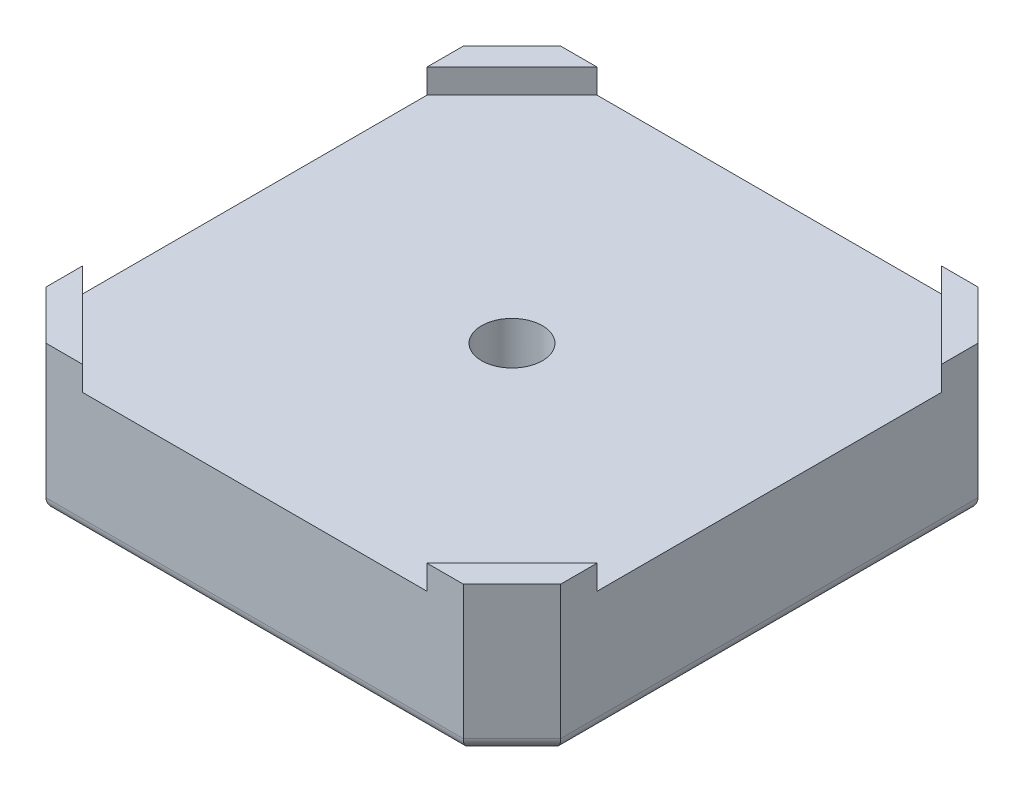
ISO-10303-21;
HEADER;
FILE_DESCRIPTION(('STEP AP214'),'2;1');
FILE_NAME('part.step','',(''),(''),'','','');
FILE_SCHEMA(('AUTOMOTIVE_DESIGN { 1 0 10303 214 1 1 1 1 }'));
ENDSEC;
DATA;
#1=APPLICATION_CONTEXT('core data for automotive mechanical design processes');
#2=APPLICATION_PROTOCOL_DEFINITION('international standard','automotive_design',2000,#1);
#3=PRODUCT_CONTEXT('',#1,'mechanical');
#4=PRODUCT('Part','Part','',(#3));
#5=PRODUCT_RELATED_PRODUCT_CATEGORY('part','',(#4));
#6=PRODUCT_DEFINITION_FORMATION('','',#4);
#7=PRODUCT_DEFINITION_CONTEXT('part definition',#1,'design');
#8=PRODUCT_DEFINITION('design','',#6,#7);
#9=PRODUCT_DEFINITION_SHAPE('','',#8);
#10=(LENGTH_UNIT() NAMED_UNIT(*) SI_UNIT(.MILLI.,.METRE.));
#11=(NAMED_UNIT(*) PLANE_ANGLE_UNIT() SI_UNIT($,.RADIAN.));
#12=(NAMED_UNIT(*) SI_UNIT($,.STERADIAN.) SOLID_ANGLE_UNIT());
#13=UNCERTAINTY_MEASURE_WITH_UNIT(LENGTH_MEASURE(1.E-05),#10,'distance_accuracy_value','');
#14=(GEOMETRIC_REPRESENTATION_CONTEXT(3) GLOBAL_UNCERTAINTY_ASSIGNED_CONTEXT((#13)) GLOBAL_UNIT_ASSIGNED_CONTEXT((#10,
#11,#12)) REPRESENTATION_CONTEXT('',''));
#15=CARTESIAN_POINT('',(0.,0.,0.));
#16=DIRECTION('',(0.,0.,1.));
#17=DIRECTION('',(1.,0.,0.));
#18=AXIS2_PLACEMENT_3D('',#15,#16,#17);
#19=CARTESIAN_POINT('',(0.,0.,0.));
#20=DIRECTION('',(0.,1.,0.));
#21=DIRECTION('',(0.,0.,1.));
#22=AXIS2_PLACEMENT_3D('',#19,#20,#21);
#23=PLANE('',#22);
#24=CARTESIAN_POINT('',(15.5,0.,-15.5));
#25=DIRECTION('',(0.,1.,0.));
#26=DIRECTION('',(0.,0.,1.));
#27=AXIS2_PLACEMENT_3D('',#24,#25,#26);
#28=CIRCLE('',#27,1.55);
#29=CARTESIAN_POINT('',(15.5,0.,-13.95));
#30=VERTEX_POINT('',#29);
#31=EDGE_CURVE('E418',#30,#30,#28,.T.);
#32=ORIENTED_EDGE('',*,*,#31,.T.);
#33=EDGE_LOOP('',(#32));
#34=FACE_BOUND('',#33,.T.);
#35=CARTESIAN_POINT('',(15.5,0.,15.5));
#36=DIRECTION('',(0.,1.,0.));
#37=DIRECTION('',(0.,0.,1.));
#38=AXIS2_PLACEMENT_3D('',#35,#36,#37);
#39=CIRCLE('',#38,1.55);
#40=CARTESIAN_POINT('',(15.5,0.,17.05));
#41=VERTEX_POINT('',#40);
#42=EDGE_CURVE('E415',#41,#41,#39,.T.);
#43=ORIENTED_EDGE('',*,*,#42,.T.);
#44=EDGE_LOOP('',(#43));
#45=FACE_BOUND('',#44,.T.);
#46=CARTESIAN_POINT('',(-15.5,0.,-15.5));
#47=DIRECTION('',(0.,1.,0.));
#48=DIRECTION('',(0.,0.,1.));
#49=AXIS2_PLACEMENT_3D('',#46,#47,#48);
#50=CIRCLE('',#49,1.55);
#51=CARTESIAN_POINT('',(-15.5,0.,-13.95));
#52=VERTEX_POINT('',#51);
#53=EDGE_CURVE('E412',#52,#52,#50,.T.);
#54=ORIENTED_EDGE('',*,*,#53,.T.);
#55=EDGE_LOOP('',(#54));
#56=FACE_BOUND('',#55,.T.);
#57=CARTESIAN_POINT('',(-15.5,0.,15.5));
#58=DIRECTION('',(0.,1.,0.));
#59=DIRECTION('',(0.,0.,1.));
#60=AXIS2_PLACEMENT_3D('',#57,#58,#59);
#61=CIRCLE('',#60,1.55);
#62=CARTESIAN_POINT('',(-15.5,0.,17.05));
#63=VERTEX_POINT('',#62);
#64=EDGE_CURVE('E409',#63,#63,#61,.T.);
#65=ORIENTED_EDGE('',*,*,#64,.T.);
#66=EDGE_LOOP('',(#65));
#67=FACE_BOUND('',#66,.T.);
#68=CARTESIAN_POINT('',(0.,0.,0.));
#69=DIRECTION('',(0.,1.,0.));
#70=DIRECTION('',(0.,0.,1.));
#71=AXIS2_PLACEMENT_3D('',#68,#69,#70);
#72=CIRCLE('',#71,11.5);
#73=CARTESIAN_POINT('',(0.,0.,11.5));
#74=VERTEX_POINT('',#73);
#75=EDGE_CURVE('E403',#74,#74,#72,.T.);
#76=ORIENTED_EDGE('',*,*,#75,.T.);
#77=EDGE_LOOP('',(#76));
#78=FACE_BOUND('',#77,.T.);
#79=DIRECTION('',(0.,0.,1.));
#80=VECTOR('',#79,1.);
#81=CARTESIAN_POINT('',(-20.15,0.,0.));
#82=LINE('',#81,#80);
#83=CARTESIAN_POINT('',(-20.15,0.,16.7357864376269));
#84=VERTEX_POINT('',#83);
#85=CARTESIAN_POINT('',(-20.15,0.,-16.7357864376269));
#86=VERTEX_POINT('',#85);
#87=EDGE_CURVE('E336',#84,#86,#82,.F.);
#88=ORIENTED_EDGE('',*,*,#87,.T.);
#89=DIRECTION('',(-0.707106781186548,0.,0.707106781186548));
#90=VECTOR('',#89,1.);
#91=CARTESIAN_POINT('',(-18.4428932188135,0.,-18.4428932188135));
#92=LINE('',#91,#90);
#93=CARTESIAN_POINT('',(-16.7357864376269,0.,-20.15));
#94=VERTEX_POINT('',#93);
#95=EDGE_CURVE('E350',#86,#94,#92,.F.);
#96=ORIENTED_EDGE('',*,*,#95,.T.);
#97=DIRECTION('',(-1.,0.,0.));
#98=VECTOR('',#97,1.);
#99=CARTESIAN_POINT('',(0.,0.,-20.15));
#100=LINE('',#99,#98);
#101=CARTESIAN_POINT('',(16.7357864376269,0.,-20.15));
#102=VERTEX_POINT('',#101);
#103=EDGE_CURVE('E348',#94,#102,#100,.F.);
#104=ORIENTED_EDGE('',*,*,#103,.T.);
#105=DIRECTION('',(-0.707106781186548,0.,-0.707106781186548));
#106=VECTOR('',#105,1.);
#107=CARTESIAN_POINT('',(18.4428932188134,0.,-18.4428932188134));
#108=LINE('',#107,#106);
#109=CARTESIAN_POINT('',(20.15,0.,-16.7357864376269));
#110=VERTEX_POINT('',#109);
#111=EDGE_CURVE('E346',#102,#110,#108,.F.);
#112=ORIENTED_EDGE('',*,*,#111,.T.);
#113=DIRECTION('',(0.,0.,-1.));
#114=VECTOR('',#113,1.);
#115=CARTESIAN_POINT('',(20.15,0.,0.));
#116=LINE('',#115,#114);
#117=CARTESIAN_POINT('',(20.15,0.,16.7357864376269));
#118=VERTEX_POINT('',#117);
#119=EDGE_CURVE('E344',#110,#118,#116,.F.);
#120=ORIENTED_EDGE('',*,*,#119,.T.);
#121=DIRECTION('',(0.707106781186548,0.,-0.707106781186548));
#122=VECTOR('',#121,1.);
#123=CARTESIAN_POINT('',(18.4428932188134,0.,18.4428932188134));
#124=LINE('',#123,#122);
#125=CARTESIAN_POINT('',(16.7357864376269,0.,20.15));
#126=VERTEX_POINT('',#125);
#127=EDGE_CURVE('E342',#118,#126,#124,.F.);
#128=ORIENTED_EDGE('',*,*,#127,.T.);
#129=DIRECTION('',(1.,0.,0.));
#130=VECTOR('',#129,1.);
#131=CARTESIAN_POINT('',(0.,0.,20.15));
#132=LINE('',#131,#130);
#133=CARTESIAN_POINT('',(-16.7357864376269,0.,20.15));
#134=VERTEX_POINT('',#133);
#135=EDGE_CURVE('E340',#126,#134,#132,.F.);
#136=ORIENTED_EDGE('',*,*,#135,.T.);
#137=DIRECTION('',(0.707106781186548,0.,0.707106781186548));
#138=VECTOR('',#137,1.);
#139=CARTESIAN_POINT('',(-18.4428932188135,0.,18.4428932188135));
#140=LINE('',#139,#138);
#141=EDGE_CURVE('E338',#134,#84,#140,.F.);
#142=ORIENTED_EDGE('',*,*,#141,.T.);
#143=EDGE_LOOP('',(#88,#96,#104,#112,#120,#128,#136,#142));
#144=FACE_BOUND('',#143,.T.);
#145=ADVANCED_FACE('F42',(#34,#45,#56,#67,#78,#144),#23,.F.);
#146=CARTESIAN_POINT('',(0.,0.,0.));
#147=DIRECTION('',(0.,1.,0.));
#148=DIRECTION('',(0.,0.,1.));
#149=AXIS2_PLACEMENT_3D('',#146,#147,#148);
#150=CYLINDRICAL_SURFACE('',#149,2.5);
#151=CARTESIAN_POINT('',(0.,10.,0.));
#152=DIRECTION('',(0.,1.,0.));
#153=DIRECTION('',(0.,0.,1.));
#154=AXIS2_PLACEMENT_3D('',#151,#152,#153);
#155=CIRCLE('',#154,2.5);
#156=CARTESIAN_POINT('',(0.,10.,2.5));
#157=VERTEX_POINT('',#156);
#158=EDGE_CURVE('E227',#157,#157,#155,.T.);
#159=ORIENTED_EDGE('',*,*,#158,.T.);
#160=EDGE_LOOP('',(#159));
#161=FACE_BOUND('',#160,.T.);
#162=CARTESIAN_POINT('',(0.,5.,0.));
#163=DIRECTION('',(0.,-1.,0.));
#164=DIRECTION('',(0.,0.,-1.));
#165=AXIS2_PLACEMENT_3D('',#162,#163,#164);
#166=CIRCLE('',#165,2.5);
#167=CARTESIAN_POINT('',(0.,5.,-2.5));
#168=VERTEX_POINT('',#167);
#169=EDGE_CURVE('E225',#168,#168,#166,.F.);
#170=ORIENTED_EDGE('',*,*,#169,.F.);
#171=EDGE_LOOP('',(#170));
#172=FACE_BOUND('',#171,.T.);
#173=ADVANCED_FACE('F443',(#161,#172),#150,.F.);
#174=CARTESIAN_POINT('',(0.,12.,0.));
#175=DIRECTION('',(0.,1.,0.));
#176=DIRECTION('',(0.,0.,1.));
#177=AXIS2_PLACEMENT_3D('',#174,#175,#176);
#178=PLANE('',#177);
#179=DIRECTION('',(-0.707106781186547,0.,0.707106781186547));
#180=VECTOR('',#179,1.);
#181=CARTESIAN_POINT('',(-21.15,12.,-14.15));
#182=LINE('',#181,#180);
#183=CARTESIAN_POINT('',(-14.15,12.,-21.15));
#184=VERTEX_POINT('',#183);
#185=CARTESIAN_POINT('',(-21.15,12.,-14.15));
#186=VERTEX_POINT('',#185);
#187=EDGE_CURVE('E230',#184,#186,#182,.T.);
#188=ORIENTED_EDGE('',*,*,#187,.F.);
#189=DIRECTION('',(-1.,0.,0.));
#190=VECTOR('',#189,1.);
#191=CARTESIAN_POINT('',(-17.15,12.,-21.15));
#192=LINE('',#191,#190);
#193=CARTESIAN_POINT('',(-17.15,12.,-21.15));
#194=VERTEX_POINT('',#193);
#195=EDGE_CURVE('E267',#184,#194,#192,.T.);
#196=ORIENTED_EDGE('',*,*,#195,.T.);
#197=DIRECTION('',(-0.707106781186548,0.,0.707106781186548));
#198=VECTOR('',#197,1.);
#199=CARTESIAN_POINT('',(-21.15,12.,-17.15));
#200=LINE('',#199,#198);
#201=CARTESIAN_POINT('',(-21.15,12.,-17.15));
#202=VERTEX_POINT('',#201);
#203=EDGE_CURVE('E288',#194,#202,#200,.T.);
#204=ORIENTED_EDGE('',*,*,#203,.T.);
#205=DIRECTION('',(0.,0.,1.));
#206=VECTOR('',#205,1.);
#207=CARTESIAN_POINT('',(-21.15,12.,17.15));
#208=LINE('',#207,#206);
#209=EDGE_CURVE('E291',#202,#186,#208,.T.);
#210=ORIENTED_EDGE('',*,*,#209,.T.);
#211=EDGE_LOOP('',(#188,#196,#204,#210));
#212=FACE_BOUND('',#211,.T.);
#213=ADVANCED_FACE('F449',(#212),#178,.T.);
#214=DIRECTION('',(-0.707106781186547,0.,-0.707106781186547));
#215=VECTOR('',#214,1.);
#216=CARTESIAN_POINT('',(21.15,12.,-14.15));
#217=LINE('',#216,#215);
#218=CARTESIAN_POINT('',(21.15,12.,-14.15));
#219=VERTEX_POINT('',#218);
#220=CARTESIAN_POINT('',(14.15,12.,-21.15));
#221=VERTEX_POINT('',#220);
#222=EDGE_CURVE('E235',#219,#221,#217,.T.);
#223=ORIENTED_EDGE('',*,*,#222,.F.);
#224=DIRECTION('',(0.,0.,-1.));
#225=VECTOR('',#224,1.);
#226=CARTESIAN_POINT('',(21.15,12.,17.15));
#227=LINE('',#226,#225);
#228=CARTESIAN_POINT('',(21.15,12.,-17.15));
#229=VERTEX_POINT('',#228);
#230=EDGE_CURVE('E303',#219,#229,#227,.T.);
#231=ORIENTED_EDGE('',*,*,#230,.T.);
#232=DIRECTION('',(-0.707106781186548,0.,-0.707106781186548));
#233=VECTOR('',#232,1.);
#234=CARTESIAN_POINT('',(21.15,12.,-17.15));
#235=LINE('',#234,#233);
#236=CARTESIAN_POINT('',(17.15,12.,-21.15));
#237=VERTEX_POINT('',#236);
#238=EDGE_CURVE('E307',#229,#237,#235,.T.);
#239=ORIENTED_EDGE('',*,*,#238,.T.);
#240=EDGE_CURVE('E285',#237,#221,#192,.T.);
#241=ORIENTED_EDGE('',*,*,#240,.T.);
#242=EDGE_LOOP('',(#223,#231,#239,#241));
#243=FACE_BOUND('',#242,.T.);
#244=ADVANCED_FACE('F638',(#243),#178,.T.);
#245=DIRECTION('',(0.707106781186547,0.,-0.707106781186547));
#246=VECTOR('',#245,1.);
#247=CARTESIAN_POINT('',(14.15,12.,21.15));
#248=LINE('',#247,#246);
#249=CARTESIAN_POINT('',(14.15,12.,21.15));
#250=VERTEX_POINT('',#249);
#251=CARTESIAN_POINT('',(21.15,12.,14.15));
#252=VERTEX_POINT('',#251);
#253=EDGE_CURVE('E261',#250,#252,#248,.T.);
#254=ORIENTED_EDGE('',*,*,#253,.F.);
#255=DIRECTION('',(1.,0.,0.));
#256=VECTOR('',#255,1.);
#257=CARTESIAN_POINT('',(-17.15,12.,21.15));
#258=LINE('',#257,#256);
#259=CARTESIAN_POINT('',(17.15,12.,21.15));
#260=VERTEX_POINT('',#259);
#261=EDGE_CURVE('E296',#250,#260,#258,.T.);
#262=ORIENTED_EDGE('',*,*,#261,.T.);
#263=DIRECTION('',(0.707106781186548,0.,-0.707106781186548));
#264=VECTOR('',#263,1.);
#265=CARTESIAN_POINT('',(17.15,12.,21.15));
#266=LINE('',#265,#264);
#267=CARTESIAN_POINT('',(21.15,12.,17.15));
#268=VERTEX_POINT('',#267);
#269=EDGE_CURVE('E300',#260,#268,#266,.T.);
#270=ORIENTED_EDGE('',*,*,#269,.T.);
#271=EDGE_CURVE('E304',#268,#252,#227,.T.);
#272=ORIENTED_EDGE('',*,*,#271,.T.);
#273=EDGE_LOOP('',(#254,#262,#270,#272));
#274=FACE_BOUND('',#273,.T.);
#275=ADVANCED_FACE('F486',(#274),#178,.T.);
#276=CARTESIAN_POINT('',(-17.15,12.,-21.15));
#277=DIRECTION('',(0.,0.,1.));
#278=DIRECTION('',(1.,0.,0.));
#279=AXIS2_PLACEMENT_3D('',#276,#277,#278);
#280=PLANE('',#279);
#281=DIRECTION('',(0.,-1.,0.));
#282=VECTOR('',#281,1.);
#283=CARTESIAN_POINT('',(17.15,12.,-21.15));
#284=LINE('',#283,#282);
#285=CARTESIAN_POINT('',(17.15,1.,-21.15));
#286=VERTEX_POINT('',#285);
#287=EDGE_CURVE('E309',#237,#286,#284,.T.);
#288=ORIENTED_EDGE('',*,*,#287,.T.);
#289=DIRECTION('',(-1.,0.,0.));
#290=VECTOR('',#289,1.);
#291=CARTESIAN_POINT('',(-17.15,1.,-21.15));
#292=LINE('',#291,#290);
#293=CARTESIAN_POINT('',(-17.15,1.,-21.15));
#294=VERTEX_POINT('',#293);
#295=EDGE_CURVE('E353',#286,#294,#292,.T.);
#296=ORIENTED_EDGE('',*,*,#295,.T.);
#297=DIRECTION('',(0.,-1.,0.));
#298=VECTOR('',#297,1.);
#299=CARTESIAN_POINT('',(-17.15,12.,-21.15));
#300=LINE('',#299,#298);
#301=EDGE_CURVE('E328',#194,#294,#300,.T.);
#302=ORIENTED_EDGE('',*,*,#301,.F.);
#303=ORIENTED_EDGE('',*,*,#195,.F.);
#304=DIRECTION('',(0.,1.,0.));
#305=VECTOR('',#304,1.);
#306=CARTESIAN_POINT('',(-14.15,10.,-21.15));
#307=LINE('',#306,#305);
#308=CARTESIAN_POINT('',(-14.15,10.,-21.15));
#309=VERTEX_POINT('',#308);
#310=EDGE_CURVE('E265',#309,#184,#307,.T.);
#311=ORIENTED_EDGE('',*,*,#310,.F.);
#312=DIRECTION('',(-1.,0.,0.));
#313=VECTOR('',#312,1.);
#314=CARTESIAN_POINT('',(-14.15,10.,-21.15));
#315=LINE('',#314,#313);
#316=CARTESIAN_POINT('',(14.15,10.,-21.15));
#317=VERTEX_POINT('',#316);
#318=EDGE_CURVE('E254',#317,#309,#315,.T.);
#319=ORIENTED_EDGE('',*,*,#318,.F.);
#320=DIRECTION('',(0.,1.,0.));
#321=VECTOR('',#320,1.);
#322=CARTESIAN_POINT('',(14.15,10.,-21.15));
#323=LINE('',#322,#321);
#324=EDGE_CURVE('E268',#317,#221,#323,.T.);
#325=ORIENTED_EDGE('',*,*,#324,.T.);
#326=ORIENTED_EDGE('',*,*,#240,.F.);
#327=EDGE_LOOP('',(#288,#296,#302,#303,#311,#319,#325,#326));
#328=FACE_BOUND('',#327,.T.);
#329=ADVANCED_FACE('F482',(#328),#280,.F.);
#330=CARTESIAN_POINT('',(-21.15,12.,-17.15));
#331=DIRECTION('',(0.707106781186547,0.,0.707106781186547));
#332=DIRECTION('',(0.707106781186548,0.,-0.707106781186548));
#333=AXIS2_PLACEMENT_3D('',#330,#331,#332);
#334=PLANE('',#333);
#335=ORIENTED_EDGE('',*,*,#301,.T.);
#336=DIRECTION('',(-0.707106781186548,0.,0.707106781186548));
#337=VECTOR('',#336,1.);
#338=CARTESIAN_POINT('',(-21.15,1.,-17.15));
#339=LINE('',#338,#337);
#340=CARTESIAN_POINT('',(-21.15,1.,-17.15));
#341=VERTEX_POINT('',#340);
#342=EDGE_CURVE('E331',#294,#341,#339,.T.);
#343=ORIENTED_EDGE('',*,*,#342,.T.);
#344=DIRECTION('',(0.,-1.,0.));
#345=VECTOR('',#344,1.);
#346=CARTESIAN_POINT('',(-21.15,12.,-17.15));
#347=LINE('',#346,#345);
#348=EDGE_CURVE('E326',#202,#341,#347,.T.);
#349=ORIENTED_EDGE('',*,*,#348,.F.);
#350=ORIENTED_EDGE('',*,*,#203,.F.);
#351=EDGE_LOOP('',(#335,#343,#349,#350));
#352=FACE_BOUND('',#351,.T.);
#353=ADVANCED_FACE('F479',(#352),#334,.F.);
#354=CARTESIAN_POINT('',(-21.15,12.,17.15));
#355=DIRECTION('',(1.,0.,0.));
#356=DIRECTION('',(0.,0.,-1.));
#357=AXIS2_PLACEMENT_3D('',#354,#355,#356);
#358=PLANE('',#357);
#359=ORIENTED_EDGE('',*,*,#348,.T.);
#360=DIRECTION('',(0.,0.,1.));
#361=VECTOR('',#360,1.);
#362=CARTESIAN_POINT('',(-21.15,1.,17.15));
#363=LINE('',#362,#361);
#364=CARTESIAN_POINT('',(-21.15,1.,17.15));
#365=VERTEX_POINT('',#364);
#366=EDGE_CURVE('E57',#341,#365,#363,.T.);
#367=ORIENTED_EDGE('',*,*,#366,.T.);
#368=DIRECTION('',(0.,-1.,0.));
#369=VECTOR('',#368,1.);
#370=CARTESIAN_POINT('',(-21.15,12.,17.15));
#371=LINE('',#370,#369);
#372=CARTESIAN_POINT('',(-21.15,12.,17.15));
#373=VERTEX_POINT('',#372);
#374=EDGE_CURVE('E324',#373,#365,#371,.T.);
#375=ORIENTED_EDGE('',*,*,#374,.F.);
#376=CARTESIAN_POINT('',(-21.15,12.,14.15));
#377=VERTEX_POINT('',#376);
#378=EDGE_CURVE('E290',#377,#373,#208,.T.);
#379=ORIENTED_EDGE('',*,*,#378,.F.);
#380=DIRECTION('',(0.,1.,0.));
#381=VECTOR('',#380,1.);
#382=CARTESIAN_POINT('',(-21.15,10.,14.15));
#383=LINE('',#382,#381);
#384=CARTESIAN_POINT('',(-21.15,10.,14.15));
#385=VERTEX_POINT('',#384);
#386=EDGE_CURVE('E281',#385,#377,#383,.T.);
#387=ORIENTED_EDGE('',*,*,#386,.F.);
#388=DIRECTION('',(0.,0.,1.));
#389=VECTOR('',#388,1.);
#390=CARTESIAN_POINT('',(-21.15,10.,14.15));
#391=LINE('',#390,#389);
#392=CARTESIAN_POINT('',(-21.15,10.,-14.15));
#393=VERTEX_POINT('',#392);
#394=EDGE_CURVE('E234',#393,#385,#391,.T.);
#395=ORIENTED_EDGE('',*,*,#394,.F.);
#396=DIRECTION('',(0.,1.,0.));
#397=VECTOR('',#396,1.);
#398=CARTESIAN_POINT('',(-21.15,10.,-14.15));
#399=LINE('',#398,#397);
#400=EDGE_CURVE('E257',#393,#186,#399,.T.);
#401=ORIENTED_EDGE('',*,*,#400,.T.);
#402=ORIENTED_EDGE('',*,*,#209,.F.);
#403=EDGE_LOOP('',(#359,#367,#375,#379,#387,#395,#401,#402));
#404=FACE_BOUND('',#403,.T.);
#405=ADVANCED_FACE('F476',(#404),#358,.F.);
#406=CARTESIAN_POINT('',(-21.15,12.,17.15));
#407=DIRECTION('',(0.707106781186547,0.,-0.707106781186547));
#408=DIRECTION('',(-0.707106781186548,0.,-0.707106781186548));
#409=AXIS2_PLACEMENT_3D('',#406,#407,#408);
#410=PLANE('',#409);
#411=ORIENTED_EDGE('',*,*,#374,.T.);
#412=DIRECTION('',(0.707106781186548,0.,0.707106781186548));
#413=VECTOR('',#412,1.);
#414=CARTESIAN_POINT('',(-21.15,1.,17.15));
#415=LINE('',#414,#413);
#416=CARTESIAN_POINT('',(-17.15,1.,21.15));
#417=VERTEX_POINT('',#416);
#418=EDGE_CURVE('E64',#365,#417,#415,.T.);
#419=ORIENTED_EDGE('',*,*,#418,.T.);
#420=DIRECTION('',(0.,-1.,0.));
#421=VECTOR('',#420,1.);
#422=CARTESIAN_POINT('',(-17.15,12.,21.15));
#423=LINE('',#422,#421);
#424=CARTESIAN_POINT('',(-17.15,12.,21.15));
#425=VERTEX_POINT('',#424);
#426=EDGE_CURVE('E322',#425,#417,#423,.T.);
#427=ORIENTED_EDGE('',*,*,#426,.F.);
#428=DIRECTION('',(0.707106781186548,0.,0.707106781186548));
#429=VECTOR('',#428,1.);
#430=CARTESIAN_POINT('',(-21.15,12.,17.15));
#431=LINE('',#430,#429);
#432=EDGE_CURVE('E294',#373,#425,#431,.T.);
#433=ORIENTED_EDGE('',*,*,#432,.F.);
#434=EDGE_LOOP('',(#411,#419,#427,#433));
#435=FACE_BOUND('',#434,.T.);
#436=ADVANCED_FACE('F472',(#435),#410,.F.);
#437=CARTESIAN_POINT('',(-17.15,12.,21.15));
#438=DIRECTION('',(0.,0.,-1.));
#439=DIRECTION('',(-1.,0.,0.));
#440=AXIS2_PLACEMENT_3D('',#437,#438,#439);
#441=PLANE('',#440);
#442=ORIENTED_EDGE('',*,*,#426,.T.);
#443=DIRECTION('',(1.,0.,0.));
#444=VECTOR('',#443,1.);
#445=CARTESIAN_POINT('',(-17.15,1.,21.15));
#446=LINE('',#445,#444);
#447=CARTESIAN_POINT('',(17.15,1.,21.15));
#448=VERTEX_POINT('',#447);
#449=EDGE_CURVE('E362',#417,#448,#446,.T.);
#450=ORIENTED_EDGE('',*,*,#449,.T.);
#451=DIRECTION('',(0.,-1.,0.));
#452=VECTOR('',#451,1.);
#453=CARTESIAN_POINT('',(17.15,12.,21.15));
#454=LINE('',#453,#452);
#455=EDGE_CURVE('E318',#260,#448,#454,.T.);
#456=ORIENTED_EDGE('',*,*,#455,.F.);
#457=ORIENTED_EDGE('',*,*,#261,.F.);
#458=DIRECTION('',(0.,1.,0.));
#459=VECTOR('',#458,1.);
#460=CARTESIAN_POINT('',(14.15,10.,21.15));
#461=LINE('',#460,#459);
#462=CARTESIAN_POINT('',(14.15,10.,21.15));
#463=VERTEX_POINT('',#462);
#464=EDGE_CURVE('E276',#463,#250,#461,.T.);
#465=ORIENTED_EDGE('',*,*,#464,.F.);
#466=DIRECTION('',(1.,0.,0.));
#467=VECTOR('',#466,1.);
#468=CARTESIAN_POINT('',(-14.15,10.,21.15));
#469=LINE('',#468,#467);
#470=CARTESIAN_POINT('',(-14.15,10.,21.15));
#471=VERTEX_POINT('',#470);
#472=EDGE_CURVE('E241',#471,#463,#469,.T.);
#473=ORIENTED_EDGE('',*,*,#472,.F.);
#474=DIRECTION('',(0.,1.,0.));
#475=VECTOR('',#474,1.);
#476=CARTESIAN_POINT('',(-14.15,10.,21.15));
#477=LINE('',#476,#475);
#478=CARTESIAN_POINT('',(-14.15,12.,21.15));
#479=VERTEX_POINT('',#478);
#480=EDGE_CURVE('E278',#471,#479,#477,.T.);
#481=ORIENTED_EDGE('',*,*,#480,.T.);
#482=EDGE_CURVE('E297',#425,#479,#258,.T.);
#483=ORIENTED_EDGE('',*,*,#482,.F.);
#484=EDGE_LOOP('',(#442,#450,#456,#457,#465,#473,#481,#483));
#485=FACE_BOUND('',#484,.T.);
#486=ADVANCED_FACE('F468',(#485),#441,.F.);
#487=CARTESIAN_POINT('',(17.15,12.,21.15));
#488=DIRECTION('',(-0.707106781186547,0.,-0.707106781186547));
#489=DIRECTION('',(-0.707106781186548,0.,0.707106781186548));
#490=AXIS2_PLACEMENT_3D('',#487,#488,#489);
#491=PLANE('',#490);
#492=ORIENTED_EDGE('',*,*,#455,.T.);
#493=DIRECTION('',(0.707106781186548,0.,-0.707106781186548));
#494=VECTOR('',#493,1.);
#495=CARTESIAN_POINT('',(17.15,1.,21.15));
#496=LINE('',#495,#494);
#497=CARTESIAN_POINT('',(21.15,1.,17.15));
#498=VERTEX_POINT('',#497);
#499=EDGE_CURVE('E359',#448,#498,#496,.T.);
#500=ORIENTED_EDGE('',*,*,#499,.T.);
#501=DIRECTION('',(0.,-1.,0.));
#502=VECTOR('',#501,1.);
#503=CARTESIAN_POINT('',(21.15,12.,17.15));
#504=LINE('',#503,#502);
#505=EDGE_CURVE('E315',#268,#498,#504,.T.);
#506=ORIENTED_EDGE('',*,*,#505,.F.);
#507=ORIENTED_EDGE('',*,*,#269,.F.);
#508=EDGE_LOOP('',(#492,#500,#506,#507));
#509=FACE_BOUND('',#508,.T.);
#510=ADVANCED_FACE('F464',(#509),#491,.F.);
#511=CARTESIAN_POINT('',(21.15,12.,17.15));
#512=DIRECTION('',(-1.,0.,0.));
#513=DIRECTION('',(0.,0.,1.));
#514=AXIS2_PLACEMENT_3D('',#511,#512,#513);
#515=PLANE('',#514);
#516=ORIENTED_EDGE('',*,*,#505,.T.);
#517=DIRECTION('',(0.,0.,-1.));
#518=VECTOR('',#517,1.);
#519=CARTESIAN_POINT('',(21.15,1.,17.15));
#520=LINE('',#519,#518);
#521=CARTESIAN_POINT('',(21.15,1.,-17.15));
#522=VERTEX_POINT('',#521);
#523=EDGE_CURVE('E357',#498,#522,#520,.T.);
#524=ORIENTED_EDGE('',*,*,#523,.T.);
#525=DIRECTION('',(0.,-1.,0.));
#526=VECTOR('',#525,1.);
#527=CARTESIAN_POINT('',(21.15,12.,-17.15));
#528=LINE('',#527,#526);
#529=EDGE_CURVE('E312',#229,#522,#528,.T.);
#530=ORIENTED_EDGE('',*,*,#529,.F.);
#531=ORIENTED_EDGE('',*,*,#230,.F.);
#532=DIRECTION('',(0.,1.,0.));
#533=VECTOR('',#532,1.);
#534=CARTESIAN_POINT('',(21.15,10.,-14.15));
#535=LINE('',#534,#533);
#536=CARTESIAN_POINT('',(21.15,10.,-14.15));
#537=VERTEX_POINT('',#536);
#538=EDGE_CURVE('E271',#537,#219,#535,.T.);
#539=ORIENTED_EDGE('',*,*,#538,.F.);
#540=DIRECTION('',(0.,0.,-1.));
#541=VECTOR('',#540,1.);
#542=CARTESIAN_POINT('',(21.15,10.,14.15));
#543=LINE('',#542,#541);
#544=CARTESIAN_POINT('',(21.15,10.,14.15));
#545=VERTEX_POINT('',#544);
#546=EDGE_CURVE('E248',#545,#537,#543,.T.);
#547=ORIENTED_EDGE('',*,*,#546,.F.);
#548=DIRECTION('',(0.,1.,0.));
#549=VECTOR('',#548,1.);
#550=CARTESIAN_POINT('',(21.15,10.,14.15));
#551=LINE('',#550,#549);
#552=EDGE_CURVE('E273',#545,#252,#551,.T.);
#553=ORIENTED_EDGE('',*,*,#552,.T.);
#554=ORIENTED_EDGE('',*,*,#271,.F.);
#555=EDGE_LOOP('',(#516,#524,#530,#531,#539,#547,#553,#554));
#556=FACE_BOUND('',#555,.T.);
#557=ADVANCED_FACE('F460',(#556),#515,.F.);
#558=CARTESIAN_POINT('',(21.15,12.,-17.15));
#559=DIRECTION('',(-0.707106781186547,0.,0.707106781186547));
#560=DIRECTION('',(0.707106781186548,0.,0.707106781186548));
#561=AXIS2_PLACEMENT_3D('',#558,#559,#560);
#562=PLANE('',#561);
#563=ORIENTED_EDGE('',*,*,#529,.T.);
#564=DIRECTION('',(-0.707106781186548,0.,-0.707106781186548));
#565=VECTOR('',#564,1.);
#566=CARTESIAN_POINT('',(21.15,1.,-17.15));
#567=LINE('',#566,#565);
#568=EDGE_CURVE('E355',#522,#286,#567,.T.);
#569=ORIENTED_EDGE('',*,*,#568,.T.);
#570=ORIENTED_EDGE('',*,*,#287,.F.);
#571=ORIENTED_EDGE('',*,*,#238,.F.);
#572=EDGE_LOOP('',(#563,#569,#570,#571));
#573=FACE_BOUND('',#572,.T.);
#574=ADVANCED_FACE('F457',(#573),#562,.F.);
#575=DIRECTION('',(0.707106781186547,0.,0.707106781186547));
#576=VECTOR('',#575,1.);
#577=CARTESIAN_POINT('',(-21.15,12.,14.15));
#578=LINE('',#577,#576);
#579=EDGE_CURVE('E259',#377,#479,#578,.T.);
#580=ORIENTED_EDGE('',*,*,#579,.F.);
#581=ORIENTED_EDGE('',*,*,#378,.T.);
#582=ORIENTED_EDGE('',*,*,#432,.T.);
#583=ORIENTED_EDGE('',*,*,#482,.T.);
#584=EDGE_LOOP('',(#580,#581,#582,#583));
#585=FACE_BOUND('',#584,.T.);
#586=ADVANCED_FACE('F455',(#585),#178,.T.);
#587=CARTESIAN_POINT('',(-21.15,10.,-14.15));
#588=DIRECTION('',(-0.707106781186547,0.,-0.707106781186547));
#589=DIRECTION('',(-0.707106781186548,0.,0.707106781186548));
#590=AXIS2_PLACEMENT_3D('',#587,#588,#589);
#591=PLANE('',#590);
#592=ORIENTED_EDGE('',*,*,#187,.T.);
#593=ORIENTED_EDGE('',*,*,#400,.F.);
#594=DIRECTION('',(-0.707106781186547,0.,0.707106781186547));
#595=VECTOR('',#594,1.);
#596=CARTESIAN_POINT('',(-21.15,10.,-14.15));
#597=LINE('',#596,#595);
#598=EDGE_CURVE('E231',#309,#393,#597,.T.);
#599=ORIENTED_EDGE('',*,*,#598,.F.);
#600=ORIENTED_EDGE('',*,*,#310,.T.);
#601=EDGE_LOOP('',(#592,#593,#599,#600));
#602=FACE_BOUND('',#601,.T.);
#603=ADVANCED_FACE('F583',(#602),#591,.F.);
#604=CARTESIAN_POINT('',(21.15,10.,-14.15));
#605=DIRECTION('',(0.707106781186547,0.,-0.707106781186547));
#606=DIRECTION('',(-0.707106781186548,0.,-0.707106781186548));
#607=AXIS2_PLACEMENT_3D('',#604,#605,#606);
#608=PLANE('',#607);
#609=ORIENTED_EDGE('',*,*,#222,.T.);
#610=ORIENTED_EDGE('',*,*,#324,.F.);
#611=DIRECTION('',(-0.707106781186547,0.,-0.707106781186547));
#612=VECTOR('',#611,1.);
#613=CARTESIAN_POINT('',(21.15,10.,-14.15));
#614=LINE('',#613,#612);
#615=EDGE_CURVE('E251',#537,#317,#614,.T.);
#616=ORIENTED_EDGE('',*,*,#615,.F.);
#617=ORIENTED_EDGE('',*,*,#538,.T.);
#618=EDGE_LOOP('',(#609,#610,#616,#617));
#619=FACE_BOUND('',#618,.T.);
#620=ADVANCED_FACE('F579',(#619),#608,.F.);
#621=CARTESIAN_POINT('',(14.15,10.,21.15));
#622=DIRECTION('',(0.707106781186547,0.,0.707106781186547));
#623=DIRECTION('',(0.707106781186548,0.,-0.707106781186548));
#624=AXIS2_PLACEMENT_3D('',#621,#622,#623);
#625=PLANE('',#624);
#626=ORIENTED_EDGE('',*,*,#253,.T.);
#627=ORIENTED_EDGE('',*,*,#552,.F.);
#628=DIRECTION('',(0.707106781186547,0.,-0.707106781186547));
#629=VECTOR('',#628,1.);
#630=CARTESIAN_POINT('',(14.15,10.,21.15));
#631=LINE('',#630,#629);
#632=EDGE_CURVE('E244',#463,#545,#631,.T.);
#633=ORIENTED_EDGE('',*,*,#632,.F.);
#634=ORIENTED_EDGE('',*,*,#464,.T.);
#635=EDGE_LOOP('',(#626,#627,#633,#634));
#636=FACE_BOUND('',#635,.T.);
#637=ADVANCED_FACE('F582',(#636),#625,.F.);
#638=CARTESIAN_POINT('',(-21.15,10.,14.15));
#639=DIRECTION('',(-0.707106781186547,0.,0.707106781186547));
#640=DIRECTION('',(0.707106781186548,0.,0.707106781186548));
#641=AXIS2_PLACEMENT_3D('',#638,#639,#640);
#642=PLANE('',#641);
#643=ORIENTED_EDGE('',*,*,#579,.T.);
#644=ORIENTED_EDGE('',*,*,#480,.F.);
#645=DIRECTION('',(0.707106781186547,0.,0.707106781186547));
#646=VECTOR('',#645,1.);
#647=CARTESIAN_POINT('',(-21.15,10.,14.15));
#648=LINE('',#647,#646);
#649=EDGE_CURVE('E238',#385,#471,#648,.T.);
#650=ORIENTED_EDGE('',*,*,#649,.F.);
#651=ORIENTED_EDGE('',*,*,#386,.T.);
#652=EDGE_LOOP('',(#643,#644,#650,#651));
#653=FACE_BOUND('',#652,.T.);
#654=ADVANCED_FACE('F577',(#653),#642,.F.);
#655=CARTESIAN_POINT('',(0.,10.,0.));
#656=DIRECTION('',(0.,1.,0.));
#657=DIRECTION('',(0.,0.,1.));
#658=AXIS2_PLACEMENT_3D('',#655,#656,#657);
#659=PLANE('',#658);
#660=ORIENTED_EDGE('',*,*,#158,.F.);
#661=EDGE_LOOP('',(#660));
#662=FACE_BOUND('',#661,.T.);
#663=ORIENTED_EDGE('',*,*,#598,.T.);
#664=ORIENTED_EDGE('',*,*,#394,.T.);
#665=ORIENTED_EDGE('',*,*,#649,.T.);
#666=ORIENTED_EDGE('',*,*,#472,.T.);
#667=ORIENTED_EDGE('',*,*,#632,.T.);
#668=ORIENTED_EDGE('',*,*,#546,.T.);
#669=ORIENTED_EDGE('',*,*,#615,.T.);
#670=ORIENTED_EDGE('',*,*,#318,.T.);
#671=EDGE_LOOP('',(#663,#664,#665,#666,#667,#668,#669,#670));
#672=FACE_BOUND('',#671,.T.);
#673=ADVANCED_FACE('F570',(#662,#672),#659,.T.);
#674=CARTESIAN_POINT('',(0.,5.,0.));
#675=DIRECTION('',(0.,-1.,0.));
#676=DIRECTION('',(0.,0.,-1.));
#677=AXIS2_PLACEMENT_3D('',#674,#675,#676);
#678=PLANE('',#677);
#679=CARTESIAN_POINT('',(0.,5.,0.));
#680=DIRECTION('',(0.,-1.,0.));
#681=DIRECTION('',(0.,0.,-1.));
#682=AXIS2_PLACEMENT_3D('',#679,#680,#681);
#683=CIRCLE('',#682,5.5);
#684=CARTESIAN_POINT('',(0.,5.,-5.5));
#685=VERTEX_POINT('',#684);
#686=EDGE_CURVE('E222',#685,#685,#683,.T.);
#687=ORIENTED_EDGE('',*,*,#686,.T.);
#688=EDGE_LOOP('',(#687));
#689=FACE_BOUND('',#688,.T.);
#690=ORIENTED_EDGE('',*,*,#169,.T.);
#691=EDGE_LOOP('',(#690));
#692=FACE_BOUND('',#691,.T.);
#693=ADVANCED_FACE('F567',(#689,#692),#678,.T.);
#694=CARTESIAN_POINT('',(0.,5.,0.));
#695=DIRECTION('',(0.,-1.,0.));
#696=DIRECTION('',(0.,0.,-1.));
#697=AXIS2_PLACEMENT_3D('',#694,#695,#696);
#698=CYLINDRICAL_SURFACE('',#697,5.5);
#699=CARTESIAN_POINT('',(0.,-1.5,0.));
#700=DIRECTION('',(0.,-1.,0.));
#701=DIRECTION('',(0.,0.,-1.));
#702=AXIS2_PLACEMENT_3D('',#699,#700,#701);
#703=CIRCLE('',#702,5.5);
#704=CARTESIAN_POINT('',(0.,-1.5,-5.5));
#705=VERTEX_POINT('',#704);
#706=EDGE_CURVE('E367',#705,#705,#703,.T.);
#707=ORIENTED_EDGE('',*,*,#706,.T.);
#708=EDGE_LOOP('',(#707));
#709=FACE_BOUND('',#708,.T.);
#710=ORIENTED_EDGE('',*,*,#686,.F.);
#711=EDGE_LOOP('',(#710));
#712=FACE_BOUND('',#711,.T.);
#713=ADVANCED_FACE('F562',(#709,#712),#698,.F.);
#714=CARTESIAN_POINT('',(0.,-2.,0.));
#715=DIRECTION('',(0.,-1.,0.));
#716=DIRECTION('',(0.,0.,-1.));
#717=AXIS2_PLACEMENT_3D('',#714,#715,#716);
#718=PLANE('',#717);
#719=CARTESIAN_POINT('',(0.,-2.,0.));
#720=DIRECTION('',(0.,-1.,0.));
#721=DIRECTION('',(0.,0.,-1.));
#722=AXIS2_PLACEMENT_3D('',#719,#720,#721);
#723=CIRCLE('',#722,6.);
#724=CARTESIAN_POINT('',(0.,-2.,-6.));
#725=VERTEX_POINT('',#724);
#726=EDGE_CURVE('E394',#725,#725,#723,.F.);
#727=ORIENTED_EDGE('',*,*,#726,.T.);
#728=EDGE_LOOP('',(#727));
#729=FACE_BOUND('',#728,.T.);
#730=CARTESIAN_POINT('',(0.,-2.,0.));
#731=DIRECTION('',(0.,-1.,0.));
#732=DIRECTION('',(0.,0.,-1.));
#733=AXIS2_PLACEMENT_3D('',#730,#731,#732);
#734=CIRCLE('',#733,10.5);
#735=CARTESIAN_POINT('',(0.,-2.,-10.5));
#736=VERTEX_POINT('',#735);
#737=EDGE_CURVE('E391',#736,#736,#734,.T.);
#738=ORIENTED_EDGE('',*,*,#737,.T.);
#739=EDGE_LOOP('',(#738));
#740=FACE_BOUND('',#739,.T.);
#741=ADVANCED_FACE('F559',(#729,#740),#718,.T.);
#742=CARTESIAN_POINT('',(0.,-2.,0.));
#743=DIRECTION('',(0.,1.,0.));
#744=DIRECTION('',(0.,0.,1.));
#745=AXIS2_PLACEMENT_3D('',#742,#743,#744);
#746=CYLINDRICAL_SURFACE('',#745,11.);
#747=CARTESIAN_POINT('',(0.,-1.5,0.));
#748=DIRECTION('',(0.,-1.,0.));
#749=DIRECTION('',(0.,0.,-1.));
#750=AXIS2_PLACEMENT_3D('',#747,#748,#749);
#751=CIRCLE('',#750,11.);
#752=CARTESIAN_POINT('',(0.,-1.5,-11.));
#753=VERTEX_POINT('',#752);
#754=EDGE_CURVE('E400',#753,#753,#751,.F.);
#755=ORIENTED_EDGE('',*,*,#754,.T.);
#756=EDGE_LOOP('',(#755));
#757=FACE_BOUND('',#756,.T.);
#758=CARTESIAN_POINT('',(0.,-0.5,0.));
#759=DIRECTION('',(0.,1.,0.));
#760=DIRECTION('',(0.,0.,1.));
#761=AXIS2_PLACEMENT_3D('',#758,#759,#760);
#762=CIRCLE('',#761,11.);
#763=CARTESIAN_POINT('',(0.,-0.5,11.));
#764=VERTEX_POINT('',#763);
#765=EDGE_CURVE('E397',#764,#764,#762,.F.);
#766=ORIENTED_EDGE('',*,*,#765,.T.);
#767=EDGE_LOOP('',(#766));
#768=FACE_BOUND('',#767,.T.);
#769=ADVANCED_FACE('F520',(#757,#768),#746,.T.);
#770=CARTESIAN_POINT('',(16.4428932188134,1.,20.4428932188134));
#771=DIRECTION('',(0.707106781186548,0.,-0.707106781186548));
#772=DIRECTION('',(-0.707106781186548,0.,-0.707106781186548));
#773=AXIS2_PLACEMENT_3D('',#770,#771,#772);
#774=CYLINDRICAL_SURFACE('',#773,1.);
#775=CARTESIAN_POINT('',(16.7357864376269,1.,20.15));
#776=DIRECTION('',(0.923879532511287,0.,-0.38268343236509));
#777=DIRECTION('',(0.38268343236509,0.,0.923879532511287));
#778=AXIS2_PLACEMENT_3D('',#775,#776,#777);
#779=ELLIPSE('',#778,1.08239220029239,1.);
#780=EDGE_CURVE('E383',#126,#448,#779,.F.);
#781=ORIENTED_EDGE('',*,*,#780,.F.);
#782=ORIENTED_EDGE('',*,*,#127,.F.);
#783=CARTESIAN_POINT('',(20.15,1.,16.7357864376269));
#784=DIRECTION('',(0.38268343236509,0.,-0.923879532511287));
#785=DIRECTION('',(0.923879532511287,0.,0.38268343236509));
#786=AXIS2_PLACEMENT_3D('',#783,#784,#785);
#787=ELLIPSE('',#786,1.08239220029239,1.);
#788=EDGE_CURVE('E226',#498,#118,#787,.T.);
#789=ORIENTED_EDGE('',*,*,#788,.F.);
#790=ORIENTED_EDGE('',*,*,#499,.F.);
#791=EDGE_LOOP('',(#781,#782,#789,#790));
#792=FACE_BOUND('',#791,.T.);
#793=ADVANCED_FACE('F516',(#792),#774,.T.);
#794=CARTESIAN_POINT('',(20.15,1.,17.15));
#795=DIRECTION('',(0.,0.,-1.));
#796=DIRECTION('',(-1.,0.,0.));
#797=AXIS2_PLACEMENT_3D('',#794,#795,#796);
#798=CYLINDRICAL_SURFACE('',#797,1.);
#799=ORIENTED_EDGE('',*,*,#788,.T.);
#800=ORIENTED_EDGE('',*,*,#119,.F.);
#801=CARTESIAN_POINT('',(20.15,1.,-16.7357864376269));
#802=DIRECTION('',(-0.38268343236509,0.,-0.923879532511287));
#803=DIRECTION('',(0.923879532511287,0.,-0.38268343236509));
#804=AXIS2_PLACEMENT_3D('',#801,#802,#803);
#805=ELLIPSE('',#804,1.08239220029239,1.);
#806=EDGE_CURVE('E380',#522,#110,#805,.T.);
#807=ORIENTED_EDGE('',*,*,#806,.F.);
#808=ORIENTED_EDGE('',*,*,#523,.F.);
#809=EDGE_LOOP('',(#799,#800,#807,#808));
#810=FACE_BOUND('',#809,.T.);
#811=ADVANCED_FACE('F512',(#810),#798,.T.);
#812=CARTESIAN_POINT('',(-17.15,1.,20.15));
#813=DIRECTION('',(1.,0.,0.));
#814=DIRECTION('',(0.,0.,-1.));
#815=AXIS2_PLACEMENT_3D('',#812,#813,#814);
#816=CYLINDRICAL_SURFACE('',#815,1.);
#817=ORIENTED_EDGE('',*,*,#780,.T.);
#818=ORIENTED_EDGE('',*,*,#449,.F.);
#819=CARTESIAN_POINT('',(-16.7357864376269,1.,20.15));
#820=DIRECTION('',(0.923879532511287,0.,0.38268343236509));
#821=DIRECTION('',(-0.38268343236509,0.,0.923879532511287));
#822=AXIS2_PLACEMENT_3D('',#819,#820,#821);
#823=ELLIPSE('',#822,1.08239220029239,1.);
#824=EDGE_CURVE('E377',#134,#417,#823,.F.);
#825=ORIENTED_EDGE('',*,*,#824,.F.);
#826=ORIENTED_EDGE('',*,*,#135,.F.);
#827=EDGE_LOOP('',(#817,#818,#825,#826));
#828=FACE_BOUND('',#827,.T.);
#829=ADVANCED_FACE('F508',(#828),#816,.T.);
#830=CARTESIAN_POINT('',(20.4428932188134,1.,-16.4428932188134));
#831=DIRECTION('',(-0.707106781186548,0.,-0.707106781186548));
#832=DIRECTION('',(-0.707106781186548,0.,0.707106781186548));
#833=AXIS2_PLACEMENT_3D('',#830,#831,#832);
#834=CYLINDRICAL_SURFACE('',#833,1.);
#835=ORIENTED_EDGE('',*,*,#806,.T.);
#836=ORIENTED_EDGE('',*,*,#111,.F.);
#837=CARTESIAN_POINT('',(16.7357864376269,1.,-20.15));
#838=DIRECTION('',(-0.923879532511287,0.,-0.38268343236509));
#839=DIRECTION('',(0.38268343236509,0.,-0.923879532511287));
#840=AXIS2_PLACEMENT_3D('',#837,#838,#839);
#841=ELLIPSE('',#840,1.08239220029239,1.);
#842=EDGE_CURVE('E374',#286,#102,#841,.T.);
#843=ORIENTED_EDGE('',*,*,#842,.F.);
#844=ORIENTED_EDGE('',*,*,#568,.F.);
#845=EDGE_LOOP('',(#835,#836,#843,#844));
#846=FACE_BOUND('',#845,.T.);
#847=ADVANCED_FACE('F504',(#846),#834,.T.);
#848=CARTESIAN_POINT('',(-20.4428932188135,1.,16.4428932188134));
#849=DIRECTION('',(0.707106781186548,0.,0.707106781186548));
#850=DIRECTION('',(0.707106781186548,0.,-0.707106781186548));
#851=AXIS2_PLACEMENT_3D('',#848,#849,#850);
#852=CYLINDRICAL_SURFACE('',#851,1.);
#853=ORIENTED_EDGE('',*,*,#824,.T.);
#854=ORIENTED_EDGE('',*,*,#418,.F.);
#855=CARTESIAN_POINT('',(-20.15,1.,16.7357864376269));
#856=DIRECTION('',(0.38268343236509,0.,0.923879532511287));
#857=DIRECTION('',(-0.923879532511287,0.,0.38268343236509));
#858=AXIS2_PLACEMENT_3D('',#855,#856,#857);
#859=ELLIPSE('',#858,1.08239220029239,1.);
#860=EDGE_CURVE('E371',#84,#365,#859,.F.);
#861=ORIENTED_EDGE('',*,*,#860,.F.);
#862=ORIENTED_EDGE('',*,*,#141,.F.);
#863=EDGE_LOOP('',(#853,#854,#861,#862));
#864=FACE_BOUND('',#863,.T.);
#865=ADVANCED_FACE('F500',(#864),#852,.T.);
#866=CARTESIAN_POINT('',(-17.15,1.,-20.15));
#867=DIRECTION('',(-1.,0.,0.));
#868=DIRECTION('',(0.,0.,1.));
#869=AXIS2_PLACEMENT_3D('',#866,#867,#868);
#870=CYLINDRICAL_SURFACE('',#869,1.);
#871=ORIENTED_EDGE('',*,*,#842,.T.);
#872=ORIENTED_EDGE('',*,*,#103,.F.);
#873=CARTESIAN_POINT('',(-16.7357864376269,1.,-20.15));
#874=DIRECTION('',(-0.923879532511287,0.,0.38268343236509));
#875=DIRECTION('',(-0.38268343236509,0.,-0.923879532511287));
#876=AXIS2_PLACEMENT_3D('',#873,#874,#875);
#877=ELLIPSE('',#876,1.08239220029239,1.);
#878=EDGE_CURVE('E369',#294,#94,#877,.T.);
#879=ORIENTED_EDGE('',*,*,#878,.F.);
#880=ORIENTED_EDGE('',*,*,#295,.F.);
#881=EDGE_LOOP('',(#871,#872,#879,#880));
#882=FACE_BOUND('',#881,.T.);
#883=ADVANCED_FACE('F496',(#882),#870,.T.);
#884=CARTESIAN_POINT('',(-20.15,1.,17.15));
#885=DIRECTION('',(0.,0.,1.));
#886=DIRECTION('',(1.,0.,0.));
#887=AXIS2_PLACEMENT_3D('',#884,#885,#886);
#888=CYLINDRICAL_SURFACE('',#887,1.);
#889=ORIENTED_EDGE('',*,*,#860,.T.);
#890=ORIENTED_EDGE('',*,*,#366,.F.);
#891=CARTESIAN_POINT('',(-20.15,1.,-16.7357864376269));
#892=DIRECTION('',(-0.38268343236509,0.,0.923879532511287));
#893=DIRECTION('',(0.923879532511287,0.,0.38268343236509));
#894=AXIS2_PLACEMENT_3D('',#891,#892,#893);
#895=ELLIPSE('',#894,1.08239220029239,1.);
#896=EDGE_CURVE('E221',#86,#341,#895,.F.);
#897=ORIENTED_EDGE('',*,*,#896,.F.);
#898=ORIENTED_EDGE('',*,*,#87,.F.);
#899=EDGE_LOOP('',(#889,#890,#897,#898));
#900=FACE_BOUND('',#899,.T.);
#901=ADVANCED_FACE('F492',(#900),#888,.T.);
#902=CARTESIAN_POINT('',(-20.4428932188135,1.,-16.4428932188134));
#903=DIRECTION('',(-0.707106781186548,0.,0.707106781186548));
#904=DIRECTION('',(0.707106781186548,0.,0.707106781186548));
#905=AXIS2_PLACEMENT_3D('',#902,#903,#904);
#906=CYLINDRICAL_SURFACE('',#905,1.);
#907=ORIENTED_EDGE('',*,*,#878,.T.);
#908=ORIENTED_EDGE('',*,*,#95,.F.);
#909=ORIENTED_EDGE('',*,*,#896,.T.);
#910=ORIENTED_EDGE('',*,*,#342,.F.);
#911=EDGE_LOOP('',(#907,#908,#909,#910));
#912=FACE_BOUND('',#911,.T.);
#913=ADVANCED_FACE('F488',(#912),#906,.T.);
#914=CARTESIAN_POINT('',(0.,-1.5,0.));
#915=DIRECTION('',(0.,-1.,0.));
#916=DIRECTION('',(0.,0.,-1.));
#917=AXIS2_PLACEMENT_3D('',#914,#915,#916);
#918=TOROIDAL_SURFACE('',#917,6.,0.5);
#919=ORIENTED_EDGE('',*,*,#726,.F.);
#920=EDGE_LOOP('',(#919));
#921=FACE_BOUND('',#920,.T.);
#922=ORIENTED_EDGE('',*,*,#706,.F.);
#923=EDGE_LOOP('',(#922));
#924=FACE_BOUND('',#923,.T.);
#925=ADVANCED_FACE('F491',(#921,#924),#918,.T.);
#926=CARTESIAN_POINT('',(0.,-1.5,0.));
#927=DIRECTION('',(0.,-1.,0.));
#928=DIRECTION('',(0.,0.,-1.));
#929=AXIS2_PLACEMENT_3D('',#926,#927,#928);
#930=TOROIDAL_SURFACE('',#929,10.5,0.5);
#931=ORIENTED_EDGE('',*,*,#754,.F.);
#932=EDGE_LOOP('',(#931));
#933=FACE_BOUND('',#932,.T.);
#934=ORIENTED_EDGE('',*,*,#737,.F.);
#935=EDGE_LOOP('',(#934));
#936=FACE_BOUND('',#935,.T.);
#937=ADVANCED_FACE('F524',(#933,#936),#930,.T.);
#938=CARTESIAN_POINT('',(0.,-0.5,0.));
#939=DIRECTION('',(0.,1.,0.));
#940=DIRECTION('',(0.,0.,1.));
#941=AXIS2_PLACEMENT_3D('',#938,#939,#940);
#942=TOROIDAL_SURFACE('',#941,11.5,0.5);
#943=ORIENTED_EDGE('',*,*,#75,.F.);
#944=EDGE_LOOP('',(#943));
#945=FACE_BOUND('',#944,.T.);
#946=ORIENTED_EDGE('',*,*,#765,.F.);
#947=EDGE_LOOP('',(#946));
#948=FACE_BOUND('',#947,.T.);
#949=ADVANCED_FACE('F528',(#945,#948),#942,.F.);
#950=CARTESIAN_POINT('',(15.5,7.5,-15.5));
#951=DIRECTION('',(0.,-1.,0.));
#952=DIRECTION('',(0.,0.,-1.));
#953=AXIS2_PLACEMENT_3D('',#950,#951,#952);
#954=CONICAL_SURFACE('',#953,1.25,1.02974425867665);
#955=CARTESIAN_POINT('',(15.5,8.25107577378445,-15.5));
#956=VERTEX_POINT('',#955);
#957=VERTEX_LOOP('',#956);
#958=FACE_BOUND('',#957,.T.);
#959=CARTESIAN_POINT('',(15.5,7.5,-15.5));
#960=DIRECTION('',(0.,-1.,0.));
#961=DIRECTION('',(0.,0.,-1.));
#962=AXIS2_PLACEMENT_3D('',#959,#960,#961);
#963=CIRCLE('',#962,1.25);
#964=CARTESIAN_POINT('',(15.5,7.5,-16.75));
#965=VERTEX_POINT('',#964);
#966=EDGE_CURVE('E218',#965,#965,#963,.T.);
#967=ORIENTED_EDGE('',*,*,#966,.T.);
#968=EDGE_LOOP('',(#967));
#969=FACE_BOUND('',#968,.T.);
#970=ADVANCED_FACE('F532',(#958,#969),#954,.F.);
#971=CARTESIAN_POINT('',(15.5,0.,-15.5));
#972=DIRECTION('',(0.,-1.,0.));
#973=DIRECTION('',(0.,0.,-1.));
#974=AXIS2_PLACEMENT_3D('',#971,#972,#973);
#975=CYLINDRICAL_SURFACE('',#974,1.25);
#976=CARTESIAN_POINT('',(15.5,0.300000000000009,-15.5));
#977=DIRECTION('',(0.,1.,0.));
#978=DIRECTION('',(0.,0.,1.));
#979=AXIS2_PLACEMENT_3D('',#976,#977,#978);
#980=CIRCLE('',#979,1.25);
#981=CARTESIAN_POINT('',(15.5,0.300000000000009,-14.25));
#982=VERTEX_POINT('',#981);
#983=EDGE_CURVE('E406',#982,#982,#980,.F.);
#984=ORIENTED_EDGE('',*,*,#983,.T.);
#985=EDGE_LOOP('',(#984));
#986=FACE_BOUND('',#985,.T.);
#987=ORIENTED_EDGE('',*,*,#966,.F.);
#988=EDGE_LOOP('',(#987));
#989=FACE_BOUND('',#988,.T.);
#990=ADVANCED_FACE('F545',(#986,#989),#975,.F.);
#991=CARTESIAN_POINT('',(-15.5,7.5,-15.5));
#992=DIRECTION('',(0.,-1.,0.));
#993=DIRECTION('',(0.,0.,-1.));
#994=AXIS2_PLACEMENT_3D('',#991,#992,#993);
#995=CONICAL_SURFACE('',#994,1.25,1.02974425867665);
#996=CARTESIAN_POINT('',(-15.5,8.25107577378445,-15.5));
#997=VERTEX_POINT('',#996);
#998=VERTEX_LOOP('',#997);
#999=FACE_BOUND('',#998,.T.);
#1000=CARTESIAN_POINT('',(-15.5,7.5,-15.5));
#1001=DIRECTION('',(0.,-1.,0.));
#1002=DIRECTION('',(0.,0.,-1.));
#1003=AXIS2_PLACEMENT_3D('',#1000,#1001,#1002);
#1004=CIRCLE('',#1003,1.25);
#1005=CARTESIAN_POINT('',(-15.5,7.5,-16.75));
#1006=VERTEX_POINT('',#1005);
#1007=EDGE_CURVE('E213',#1006,#1006,#1004,.T.);
#1008=ORIENTED_EDGE('',*,*,#1007,.T.);
#1009=EDGE_LOOP('',(#1008));
#1010=FACE_BOUND('',#1009,.T.);
#1011=ADVANCED_FACE('F548',(#999,#1010),#995,.F.);
#1012=CARTESIAN_POINT('',(-15.5,0.,-15.5));
#1013=DIRECTION('',(0.,-1.,0.));
#1014=DIRECTION('',(0.,0.,-1.));
#1015=AXIS2_PLACEMENT_3D('',#1012,#1013,#1014);
#1016=CYLINDRICAL_SURFACE('',#1015,1.25);
#1017=CARTESIAN_POINT('',(-15.5,0.30000000000001,-15.5));
#1018=DIRECTION('',(0.,1.,0.));
#1019=DIRECTION('',(0.,0.,1.));
#1020=AXIS2_PLACEMENT_3D('',#1017,#1018,#1019);
#1021=CIRCLE('',#1020,1.25);
#1022=CARTESIAN_POINT('',(-15.5,0.30000000000001,-14.25));
#1023=VERTEX_POINT('',#1022);
#1024=EDGE_CURVE('E50',#1023,#1023,#1021,.F.);
#1025=ORIENTED_EDGE('',*,*,#1024,.T.);
#1026=EDGE_LOOP('',(#1025));
#1027=FACE_BOUND('',#1026,.T.);
#1028=ORIENTED_EDGE('',*,*,#1007,.F.);
#1029=EDGE_LOOP('',(#1028));
#1030=FACE_BOUND('',#1029,.T.);
#1031=ADVANCED_FACE('F426',(#1027,#1030),#1016,.F.);
#1032=CARTESIAN_POINT('',(-15.5,7.5,15.5));
#1033=DIRECTION('',(0.,-1.,0.));
#1034=DIRECTION('',(0.,0.,-1.));
#1035=AXIS2_PLACEMENT_3D('',#1032,#1033,#1034);
#1036=CONICAL_SURFACE('',#1035,1.25,1.02974425867665);
#1037=CARTESIAN_POINT('',(-15.5,8.25107577378445,15.5));
#1038=VERTEX_POINT('',#1037);
#1039=VERTEX_LOOP('',#1038);
#1040=FACE_BOUND('',#1039,.T.);
#1041=CARTESIAN_POINT('',(-15.5,7.5,15.5));
#1042=DIRECTION('',(0.,-1.,0.));
#1043=DIRECTION('',(0.,0.,-1.));
#1044=AXIS2_PLACEMENT_3D('',#1041,#1042,#1043);
#1045=CIRCLE('',#1044,1.25);
#1046=CARTESIAN_POINT('',(-15.5,7.5,14.25));
#1047=VERTEX_POINT('',#1046);
#1048=EDGE_CURVE('E208',#1047,#1047,#1045,.T.);
#1049=ORIENTED_EDGE('',*,*,#1048,.T.);
#1050=EDGE_LOOP('',(#1049));
#1051=FACE_BOUND('',#1050,.T.);
#1052=ADVANCED_FACE('F834',(#1040,#1051),#1036,.F.);
#1053=CARTESIAN_POINT('',(-15.5,0.,15.5));
#1054=DIRECTION('',(0.,-1.,0.));
#1055=DIRECTION('',(0.,0.,-1.));
#1056=AXIS2_PLACEMENT_3D('',#1053,#1054,#1055);
#1057=CYLINDRICAL_SURFACE('',#1056,1.25);
#1058=CARTESIAN_POINT('',(-15.5,0.30000000000001,15.5));
#1059=DIRECTION('',(0.,1.,0.));
#1060=DIRECTION('',(0.,0.,1.));
#1061=AXIS2_PLACEMENT_3D('',#1058,#1059,#1060);
#1062=CIRCLE('',#1061,1.25);
#1063=CARTESIAN_POINT('',(-15.5,0.30000000000001,16.75));
#1064=VERTEX_POINT('',#1063);
#1065=EDGE_CURVE('E11',#1064,#1064,#1062,.F.);
#1066=ORIENTED_EDGE('',*,*,#1065,.T.);
#1067=EDGE_LOOP('',(#1066));
#1068=FACE_BOUND('',#1067,.T.);
#1069=ORIENTED_EDGE('',*,*,#1048,.F.);
#1070=EDGE_LOOP('',(#1069));
#1071=FACE_BOUND('',#1070,.T.);
#1072=ADVANCED_FACE('F201',(#1068,#1071),#1057,.F.);
#1073=CARTESIAN_POINT('',(15.5,7.5,15.5));
#1074=DIRECTION('',(0.,-1.,0.));
#1075=DIRECTION('',(0.,0.,-1.));
#1076=AXIS2_PLACEMENT_3D('',#1073,#1074,#1075);
#1077=CONICAL_SURFACE('',#1076,1.25,1.02974425867665);
#1078=CARTESIAN_POINT('',(15.5,8.25107577378445,15.5));
#1079=VERTEX_POINT('',#1078);
#1080=VERTEX_LOOP('',#1079);
#1081=FACE_BOUND('',#1080,.T.);
#1082=CARTESIAN_POINT('',(15.5,7.5,15.5));
#1083=DIRECTION('',(0.,-1.,0.));
#1084=DIRECTION('',(0.,0.,-1.));
#1085=AXIS2_PLACEMENT_3D('',#1082,#1083,#1084);
#1086=CIRCLE('',#1085,1.25);
#1087=CARTESIAN_POINT('',(15.5,7.5,14.25));
#1088=VERTEX_POINT('',#1087);
#1089=EDGE_CURVE('E205',#1088,#1088,#1086,.T.);
#1090=ORIENTED_EDGE('',*,*,#1089,.T.);
#1091=EDGE_LOOP('',(#1090));
#1092=FACE_BOUND('',#1091,.T.);
#1093=ADVANCED_FACE('F197',(#1081,#1092),#1077,.F.);
#1094=CARTESIAN_POINT('',(15.5,0.,15.5));
#1095=DIRECTION('',(0.,-1.,0.));
#1096=DIRECTION('',(0.,0.,-1.));
#1097=AXIS2_PLACEMENT_3D('',#1094,#1095,#1096);
#1098=CYLINDRICAL_SURFACE('',#1097,1.25);
#1099=CARTESIAN_POINT('',(15.5,0.300000000000009,15.5));
#1100=DIRECTION('',(0.,1.,0.));
#1101=DIRECTION('',(0.,0.,1.));
#1102=AXIS2_PLACEMENT_3D('',#1099,#1100,#1101);
#1103=CIRCLE('',#1102,1.25);
#1104=CARTESIAN_POINT('',(15.5,0.300000000000009,16.75));
#1105=VERTEX_POINT('',#1104);
#1106=EDGE_CURVE('E421',#1105,#1105,#1103,.F.);
#1107=ORIENTED_EDGE('',*,*,#1106,.T.);
#1108=EDGE_LOOP('',(#1107));
#1109=FACE_BOUND('',#1108,.T.);
#1110=ORIENTED_EDGE('',*,*,#1089,.F.);
#1111=EDGE_LOOP('',(#1110));
#1112=FACE_BOUND('',#1111,.T.);
#1113=ADVANCED_FACE('F200',(#1109,#1112),#1098,.F.);
#1114=CARTESIAN_POINT('',(15.5,0.300000000000009,-15.5));
#1115=DIRECTION('',(0.,-1.,0.));
#1116=DIRECTION('',(0.,0.,-1.));
#1117=AXIS2_PLACEMENT_3D('',#1114,#1115,#1116);
#1118=CONICAL_SURFACE('',#1117,1.25,0.785398163397441);
#1119=ORIENTED_EDGE('',*,*,#31,.F.);
#1120=EDGE_LOOP('',(#1119));
#1121=FACE_BOUND('',#1120,.T.);
#1122=ORIENTED_EDGE('',*,*,#983,.F.);
#1123=EDGE_LOOP('',(#1122));
#1124=FACE_BOUND('',#1123,.T.);
#1125=ADVANCED_FACE('F438',(#1121,#1124),#1118,.F.);
#1126=CARTESIAN_POINT('',(15.5,0.300000000000009,15.5));
#1127=DIRECTION('',(0.,-1.,0.));
#1128=DIRECTION('',(0.,0.,-1.));
#1129=AXIS2_PLACEMENT_3D('',#1126,#1127,#1128);
#1130=CONICAL_SURFACE('',#1129,1.25,0.785398163397444);
#1131=ORIENTED_EDGE('',*,*,#42,.F.);
#1132=EDGE_LOOP('',(#1131));
#1133=FACE_BOUND('',#1132,.T.);
#1134=ORIENTED_EDGE('',*,*,#1106,.F.);
#1135=EDGE_LOOP('',(#1134));
#1136=FACE_BOUND('',#1135,.T.);
#1137=ADVANCED_FACE('F431',(#1133,#1136),#1130,.F.);
#1138=CARTESIAN_POINT('',(-15.5,0.30000000000001,-15.5));
#1139=DIRECTION('',(0.,-1.,0.));
#1140=DIRECTION('',(0.,0.,-1.));
#1141=AXIS2_PLACEMENT_3D('',#1138,#1139,#1140);
#1142=CONICAL_SURFACE('',#1141,1.25,0.785398163397441);
#1143=ORIENTED_EDGE('',*,*,#53,.F.);
#1144=EDGE_LOOP('',(#1143));
#1145=FACE_BOUND('',#1144,.T.);
#1146=ORIENTED_EDGE('',*,*,#1024,.F.);
#1147=EDGE_LOOP('',(#1146));
#1148=FACE_BOUND('',#1147,.T.);
#1149=ADVANCED_FACE('F429',(#1145,#1148),#1142,.F.);
#1150=CARTESIAN_POINT('',(-15.5,0.30000000000001,15.5));
#1151=DIRECTION('',(0.,-1.,0.));
#1152=DIRECTION('',(0.,0.,-1.));
#1153=AXIS2_PLACEMENT_3D('',#1150,#1151,#1152);
#1154=CONICAL_SURFACE('',#1153,1.25,0.785398163397438);
#1155=ORIENTED_EDGE('',*,*,#64,.F.);
#1156=EDGE_LOOP('',(#1155));
#1157=FACE_BOUND('',#1156,.T.);
#1158=ORIENTED_EDGE('',*,*,#1065,.F.);
#1159=EDGE_LOOP('',(#1158));
#1160=FACE_BOUND('',#1159,.T.);
#1161=ADVANCED_FACE('F44',(#1157,#1160),#1154,.F.);
#1162=CLOSED_SHELL('',(#145,#173,#213,#244,#275,#329,#353,#405,#436,#486,#510,#557,#574,#586,
#603,#620,#637,#654,#673,#693,#713,#741,#769,#793,#811,#829,#847,#865,#883,#901,#913,#925,#937,
#949,#970,#990,#1011,#1031,#1052,#1072,#1093,#1113,#1125,#1137,#1149,#1161));
#1163=MANIFOLD_SOLID_BREP('B2',#1162);
#1164=ADVANCED_BREP_SHAPE_REPRESENTATION('',(#18,#1163),#14);
#1165=SHAPE_DEFINITION_REPRESENTATION(#9,#1164);
ENDSEC;
END-ISO-10303-21;
